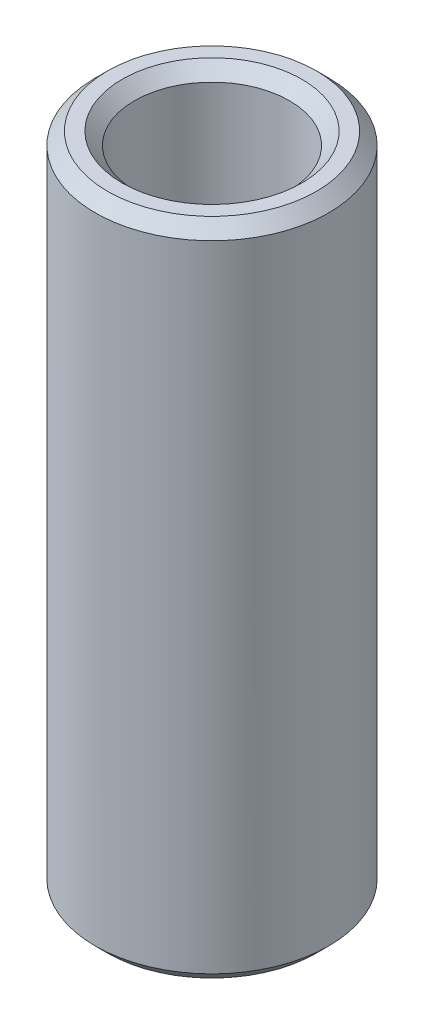
ISO-10303-21;
HEADER;
FILE_DESCRIPTION(('STEP AP214'),'2;1');
FILE_NAME('part.step','',(''),(''),'','','');
FILE_SCHEMA(('AUTOMOTIVE_DESIGN { 1 0 10303 214 1 1 1 1 }'));
ENDSEC;
DATA;
#1=APPLICATION_CONTEXT('core data for automotive mechanical design processes');
#2=APPLICATION_PROTOCOL_DEFINITION('international standard','automotive_design',2000,#1);
#3=PRODUCT_CONTEXT('',#1,'mechanical');
#4=PRODUCT('Part','Part','',(#3));
#5=PRODUCT_RELATED_PRODUCT_CATEGORY('part','',(#4));
#6=PRODUCT_DEFINITION_FORMATION('','',#4);
#7=PRODUCT_DEFINITION_CONTEXT('part definition',#1,'design');
#8=PRODUCT_DEFINITION('design','',#6,#7);
#9=PRODUCT_DEFINITION_SHAPE('','',#8);
#10=(LENGTH_UNIT() NAMED_UNIT(*) SI_UNIT(.MILLI.,.METRE.));
#11=(NAMED_UNIT(*) PLANE_ANGLE_UNIT() SI_UNIT($,.RADIAN.));
#12=(NAMED_UNIT(*) SI_UNIT($,.STERADIAN.) SOLID_ANGLE_UNIT());
#13=UNCERTAINTY_MEASURE_WITH_UNIT(LENGTH_MEASURE(1.E-05),#10,'distance_accuracy_value','');
#14=(GEOMETRIC_REPRESENTATION_CONTEXT(3) GLOBAL_UNCERTAINTY_ASSIGNED_CONTEXT((#13)) GLOBAL_UNIT_ASSIGNED_CONTEXT((#10,
#11,#12)) REPRESENTATION_CONTEXT('',''));
#15=CARTESIAN_POINT('',(0.,0.,0.));
#16=DIRECTION('',(0.,0.,1.));
#17=DIRECTION('',(1.,0.,0.));
#18=AXIS2_PLACEMENT_3D('',#15,#16,#17);
#19=CARTESIAN_POINT('',(0.,155.341796821671,0.));
#20=DIRECTION('',(0.,-1.,0.));
#21=DIRECTION('',(0.,0.,-1.));
#22=AXIS2_PLACEMENT_3D('',#19,#20,#21);
#23=CYLINDRICAL_SURFACE('',#22,27.5);
#24=CARTESIAN_POINT('',(0.,2.91568052308544,0.));
#25=DIRECTION('',(0.,1.,0.));
#26=DIRECTION('',(0.,0.,1.));
#27=AXIS2_PLACEMENT_3D('',#24,#25,#26);
#28=CIRCLE('',#27,27.5);
#29=CARTESIAN_POINT('',(0.,2.91568052308544,27.5));
#30=VERTEX_POINT('',#29);
#31=EDGE_CURVE('E10',#30,#30,#28,.T.);
#32=ORIENTED_EDGE('',*,*,#31,.T.);
#33=EDGE_LOOP('',(#32));
#34=FACE_BOUND('',#33,.T.);
#35=CARTESIAN_POINT('',(0.,152.426116298586,0.));
#36=DIRECTION('',(0.,1.,0.));
#37=DIRECTION('',(0.,0.,1.));
#38=AXIS2_PLACEMENT_3D('',#35,#36,#37);
#39=CIRCLE('',#38,27.5);
#40=CARTESIAN_POINT('',(0.,152.426116298586,-27.5));
#41=VERTEX_POINT('',#40);
#42=EDGE_CURVE('E50',#41,#41,#39,.F.);
#43=ORIENTED_EDGE('',*,*,#42,.T.);
#44=EDGE_LOOP('',(#43));
#45=FACE_BOUND('',#44,.T.);
#46=ADVANCED_FACE('F39',(#34,#45),#23,.T.);
#47=CARTESIAN_POINT('',(0.,155.341796821671,0.));
#48=DIRECTION('',(0.,1.,0.));
#49=DIRECTION('',(0.,0.,1.));
#50=AXIS2_PLACEMENT_3D('',#47,#48,#49);
#51=PLANE('',#50);
#52=CARTESIAN_POINT('',(0.,155.341796821671,0.));
#53=DIRECTION('',(0.,1.,0.));
#54=DIRECTION('',(0.,0.,1.));
#55=AXIS2_PLACEMENT_3D('',#52,#53,#54);
#56=CIRCLE('',#55,21.167257633111);
#57=CARTESIAN_POINT('',(0.,155.341796821671,21.167257633111));
#58=VERTEX_POINT('',#57);
#59=EDGE_CURVE('E58',#58,#58,#56,.F.);
#60=ORIENTED_EDGE('',*,*,#59,.T.);
#61=EDGE_LOOP('',(#60));
#62=FACE_BOUND('',#61,.T.);
#63=CARTESIAN_POINT('',(0.,155.341796821671,0.));
#64=DIRECTION('',(0.,1.,0.));
#65=DIRECTION('',(0.,0.,1.));
#66=AXIS2_PLACEMENT_3D('',#63,#64,#65);
#67=CIRCLE('',#66,24.5843194769146);
#68=CARTESIAN_POINT('',(0.,155.341796821671,-24.5843194769146));
#69=VERTEX_POINT('',#68);
#70=EDGE_CURVE('E61',#69,#69,#67,.T.);
#71=ORIENTED_EDGE('',*,*,#70,.T.);
#72=EDGE_LOOP('',(#71));
#73=FACE_BOUND('',#72,.T.);
#74=ADVANCED_FACE('F88',(#62,#73),#51,.T.);
#75=CARTESIAN_POINT('',(0.,0.,0.));
#76=DIRECTION('',(0.,1.,0.));
#77=DIRECTION('',(0.,0.,1.));
#78=AXIS2_PLACEMENT_3D('',#75,#76,#77);
#79=PLANE('',#78);
#80=CARTESIAN_POINT('',(0.,0.,0.));
#81=DIRECTION('',(0.,1.,0.));
#82=DIRECTION('',(0.,0.,1.));
#83=AXIS2_PLACEMENT_3D('',#80,#81,#82);
#84=CIRCLE('',#83,21.167257633111);
#85=CARTESIAN_POINT('',(0.,0.,-21.167257633111));
#86=VERTEX_POINT('',#85);
#87=EDGE_CURVE('E51',#86,#86,#84,.T.);
#88=ORIENTED_EDGE('',*,*,#87,.T.);
#89=EDGE_LOOP('',(#88));
#90=FACE_BOUND('',#89,.T.);
#91=CARTESIAN_POINT('',(0.,0.,0.));
#92=DIRECTION('',(0.,1.,0.));
#93=DIRECTION('',(0.,0.,1.));
#94=AXIS2_PLACEMENT_3D('',#91,#92,#93);
#95=CIRCLE('',#94,24.5843194769145);
#96=CARTESIAN_POINT('',(0.,0.,24.5843194769145));
#97=VERTEX_POINT('',#96);
#98=EDGE_CURVE('E54',#97,#97,#95,.F.);
#99=ORIENTED_EDGE('',*,*,#98,.T.);
#100=EDGE_LOOP('',(#99));
#101=FACE_BOUND('',#100,.T.);
#102=ADVANCED_FACE('F83',(#90,#101),#79,.F.);
#103=CARTESIAN_POINT('',(0.,155.341796821671,0.));
#104=DIRECTION('',(0.,-1.,0.));
#105=DIRECTION('',(0.,0.,-1.));
#106=AXIS2_PLACEMENT_3D('',#103,#104,#105);
#107=CYLINDRICAL_SURFACE('',#106,18.2515771100256);
#108=CARTESIAN_POINT('',(0.,152.426116298586,0.));
#109=DIRECTION('',(0.,1.,0.));
#110=DIRECTION('',(0.,0.,1.));
#111=AXIS2_PLACEMENT_3D('',#108,#109,#110);
#112=CIRCLE('',#111,18.2515771100256);
#113=CARTESIAN_POINT('',(0.,152.426116298586,18.2515771100256));
#114=VERTEX_POINT('',#113);
#115=EDGE_CURVE('E67',#114,#114,#112,.T.);
#116=ORIENTED_EDGE('',*,*,#115,.T.);
#117=EDGE_LOOP('',(#116));
#118=FACE_BOUND('',#117,.T.);
#119=CARTESIAN_POINT('',(0.,2.91568052308547,0.));
#120=DIRECTION('',(0.,1.,0.));
#121=DIRECTION('',(0.,0.,1.));
#122=AXIS2_PLACEMENT_3D('',#119,#120,#121);
#123=CIRCLE('',#122,18.2515771100256);
#124=CARTESIAN_POINT('',(0.,2.91568052308547,-18.2515771100256));
#125=VERTEX_POINT('',#124);
#126=EDGE_CURVE('E69',#125,#125,#123,.F.);
#127=ORIENTED_EDGE('',*,*,#126,.T.);
#128=EDGE_LOOP('',(#127));
#129=FACE_BOUND('',#128,.T.);
#130=ADVANCED_FACE('F71',(#118,#129),#107,.F.);
#131=CARTESIAN_POINT('',(0.,152.426116298586,0.));
#132=DIRECTION('',(0.,1.,0.));
#133=DIRECTION('',(0.,0.,1.));
#134=AXIS2_PLACEMENT_3D('',#131,#132,#133);
#135=CONICAL_SURFACE('',#134,18.2515771100256,0.785398163397449);
#136=ORIENTED_EDGE('',*,*,#59,.F.);
#137=EDGE_LOOP('',(#136));
#138=FACE_BOUND('',#137,.T.);
#139=ORIENTED_EDGE('',*,*,#115,.F.);
#140=EDGE_LOOP('',(#139));
#141=FACE_BOUND('',#140,.T.);
#142=ADVANCED_FACE('F77',(#138,#141),#135,.F.);
#143=CARTESIAN_POINT('',(0.,0.,0.));
#144=DIRECTION('',(0.,-1.,0.));
#145=DIRECTION('',(0.,0.,-1.));
#146=AXIS2_PLACEMENT_3D('',#143,#144,#145);
#147=CONICAL_SURFACE('',#146,21.167257633111,0.785398163397444);
#148=CARTESIAN_POINT('',(0.,2.91568052308547,-18.2515771100256));
#149=CARTESIAN_POINT('',(0.,2.88530885096999,-18.281948782141));
#150=CARTESIAN_POINT('',(0.,2.85493717885452,-18.3123204542565));
#151=CARTESIAN_POINT('',(0.,2.79419383462357,-18.3730637984875));
#152=CARTESIAN_POINT('',(0.,2.7638221625081,-18.4034354706029));
#153=CARTESIAN_POINT('',(0.,2.70307881827715,-18.4641788148339));
#154=CARTESIAN_POINT('',(0.,2.67270714616168,-18.4945504869493));
#155=CARTESIAN_POINT('',(0.,2.61196380193073,-18.5552938311803));
#156=CARTESIAN_POINT('',(0.,2.58159212981526,-18.5856655032958));
#157=CARTESIAN_POINT('',(0.,2.52084878558431,-18.6464088475267));
#158=CARTESIAN_POINT('',(0.,2.49047711346884,-18.6767805196422));
#159=CARTESIAN_POINT('',(0.,2.42973376923789,-18.7375238638731));
#160=CARTESIAN_POINT('',(0.,2.39936209712242,-18.7678955359886));
#161=CARTESIAN_POINT('',(0.,2.33861875289147,-18.8286388802196));
#162=CARTESIAN_POINT('',(0.,2.30824708077599,-18.859010552335));
#163=CARTESIAN_POINT('',(0.,2.24750373654505,-18.919753896566));
#164=CARTESIAN_POINT('',(0.,2.21713206442957,-18.9501255686814));
#165=CARTESIAN_POINT('',(0.,2.15638872019863,-19.0108689129124));
#166=CARTESIAN_POINT('',(0.,2.12601704808315,-19.0412405850279));
#167=CARTESIAN_POINT('',(0.,2.06527370385221,-19.1019839292588));
#168=CARTESIAN_POINT('',(0.,2.03490203173673,-19.1323556013743));
#169=CARTESIAN_POINT('',(0.,1.97415868750579,-19.1930989456052));
#170=CARTESIAN_POINT('',(0.,1.94378701539031,-19.2234706177207));
#171=CARTESIAN_POINT('',(0.,1.88304367115936,-19.2842139619517));
#172=CARTESIAN_POINT('',(0.,1.85267199904389,-19.3145856340671));
#173=CARTESIAN_POINT('',(0.,1.79192865481294,-19.3753289782981));
#174=CARTESIAN_POINT('',(0.,1.76155698269747,-19.4057006504135));
#175=CARTESIAN_POINT('',(0.,1.70081363846652,-19.4664439946445));
#176=CARTESIAN_POINT('',(0.,1.67044196635105,-19.49681566676));
#177=CARTESIAN_POINT('',(0.,1.6096986221201,-19.5575590109909));
#178=CARTESIAN_POINT('',(0.,1.57932695000463,-19.5879306831064));
#179=CARTESIAN_POINT('',(0.,1.51858360577368,-19.6486740273373));
#180=CARTESIAN_POINT('',(0.,1.48821193365821,-19.6790456994528));
#181=CARTESIAN_POINT('',(0.,1.42746858942726,-19.7397890436838));
#182=CARTESIAN_POINT('',(0.,1.39709691731179,-19.7701607157992));
#183=CARTESIAN_POINT('',(0.,1.33635357308084,-19.8309040600302));
#184=CARTESIAN_POINT('',(0.,1.30598190096537,-19.8612757321456));
#185=CARTESIAN_POINT('',(0.,1.24523855673442,-19.9220190763766));
#186=CARTESIAN_POINT('',(0.,1.21486688461894,-19.9523907484921));
#187=CARTESIAN_POINT('',(0.,1.154123540388,-20.013134092723));
#188=CARTESIAN_POINT('',(0.,1.12375186827252,-20.0435057648385));
#189=CARTESIAN_POINT('',(0.,1.06300852404158,-20.1042491090694));
#190=CARTESIAN_POINT('',(0.,1.0326368519261,-20.1346207811849));
#191=CARTESIAN_POINT('',(0.,0.971893507695156,-20.1953641254159));
#192=CARTESIAN_POINT('',(0.,0.941521835579682,-20.2257357975313));
#193=CARTESIAN_POINT('',(0.,0.880778491348735,-20.2864791417623));
#194=CARTESIAN_POINT('',(0.,0.850406819233261,-20.3168508138777));
#195=CARTESIAN_POINT('',(0.,0.789663475002314,-20.3775941581087));
#196=CARTESIAN_POINT('',(0.,0.75929180288684,-20.4079658302242));
#197=CARTESIAN_POINT('',(0.,0.698548458655893,-20.4687091744551));
#198=CARTESIAN_POINT('',(0.,0.66817678654042,-20.4990808465706));
#199=CARTESIAN_POINT('',(0.,0.607433442309472,-20.5598241908015));
#200=CARTESIAN_POINT('',(0.,0.577061770193999,-20.590195862917));
#201=CARTESIAN_POINT('',(0.,0.516318425963051,-20.650939207148));
#202=CARTESIAN_POINT('',(0.,0.485946753847578,-20.6813108792634));
#203=CARTESIAN_POINT('',(0.,0.425203409616631,-20.7420542234944));
#204=CARTESIAN_POINT('',(0.,0.394831737501157,-20.7724258956098));
#205=CARTESIAN_POINT('',(0.,0.33408839327021,-20.8331692398408));
#206=CARTESIAN_POINT('',(0.,0.303716721154736,-20.8635409119563));
#207=CARTESIAN_POINT('',(0.,0.242973376923789,-20.9242842561872));
#208=CARTESIAN_POINT('',(0.,0.212601704808315,-20.9546559283027));
#209=CARTESIAN_POINT('',(0.,0.151858360577368,-21.0153992725336));
#210=CARTESIAN_POINT('',(0.,0.121486688461894,-21.0457709446491));
#211=CARTESIAN_POINT('',(0.,0.0607433442309472,-21.1065142888801));
#212=CARTESIAN_POINT('',(0.,0.0303716721154736,-21.1368859609955));
#213=CARTESIAN_POINT('',(0.,0.,-21.167257633111));
#214=B_SPLINE_CURVE_WITH_KNOTS('',3,(#148,#149,#150,#151,#152,#153,#154,#155,#156,#157,#158,
#159,#160,#161,#162,#163,#164,#165,#166,#167,#168,#169,#170,#171,#172,#173,#174,#175,#176,#177,
#178,#179,#180,#181,#182,#183,#184,#185,#186,#187,#188,#189,#190,#191,#192,#193,#194,#195,#196,
#197,#198,#199,#200,#201,#202,#203,#204,#205,#206,#207,#208,#209,#210,#211,#212,#213),
.UNSPECIFIED.,.F.,.F.,(4,2,2,2,2,2,2,2,2,2,2,2,2,2,2,2,2,2,2,2,2,2,2,2,2,2,2,2,2,2,2,2,4),(0.,
0.128856091852954,0.257712183705908,0.386568275558862,0.515424367411816,0.64428045926477,
0.773136551117724,0.901992642970678,1.03084873482363,1.15970482667659,1.28856091852954,
1.41741701038249,1.54627310223545,1.6751291940884,1.80398528594136,1.93284137779431,
2.06169746964727,2.19055356150022,2.31940965335317,2.44826574520613,2.57712183705908,
2.70597792891204,2.83483402076499,2.96369011261794,3.0925462044709,3.22140229632385,
3.35025838817681,3.47911448002976,3.60797057188272,3.73682666373567,3.86568275558862,
3.99453884744158,4.12339493929453),.UNSPECIFIED.);
#215=EDGE_CURVE('BSEAM73',#125,#86,#214,.T.);
#216=ORIENTED_EDGE('',*,*,#126,.F.);
#217=ORIENTED_EDGE('',*,*,#87,.F.);
#218=ORIENTED_EDGE('',*,*,#215,.T.);
#219=ORIENTED_EDGE('',*,*,#215,.F.);
#220=EDGE_LOOP('',(#216,#218,#217,#219));
#221=FACE_BOUND('',#220,.T.);
#222=ADVANCED_FACE('F73',(#221),#147,.F.);
#223=CARTESIAN_POINT('',(0.,2.91568052308544,0.));
#224=DIRECTION('',(0.,1.,0.));
#225=DIRECTION('',(0.,0.,1.));
#226=AXIS2_PLACEMENT_3D('',#223,#224,#225);
#227=CONICAL_SURFACE('',#226,27.5,0.785398163397454);
#228=ORIENTED_EDGE('',*,*,#98,.F.);
#229=EDGE_LOOP('',(#228));
#230=FACE_BOUND('',#229,.T.);
#231=ORIENTED_EDGE('',*,*,#31,.F.);
#232=EDGE_LOOP('',(#231));
#233=FACE_BOUND('',#232,.T.);
#234=ADVANCED_FACE('F76',(#230,#233),#227,.T.);
#235=CARTESIAN_POINT('',(0.,155.341796821671,0.));
#236=DIRECTION('',(0.,-1.,0.));
#237=DIRECTION('',(0.,0.,-1.));
#238=AXIS2_PLACEMENT_3D('',#235,#236,#237);
#239=CONICAL_SURFACE('',#238,24.5843194769146,0.785398163397444);
#240=CARTESIAN_POINT('',(0.,152.426116298586,-27.5));
#241=CARTESIAN_POINT('',(0.,152.456487970701,-27.4696283278845));
#242=CARTESIAN_POINT('',(0.,152.486859642817,-27.4392566557691));
#243=CARTESIAN_POINT('',(0.,152.547602987048,-27.3785133115381));
#244=CARTESIAN_POINT('',(0.,152.577974659163,-27.3481416394226));
#245=CARTESIAN_POINT('',(0.,152.638718003394,-27.2873982951917));
#246=CARTESIAN_POINT('',(0.,152.66908967551,-27.2570266230762));
#247=CARTESIAN_POINT('',(0.,152.72983301974,-27.1962832788453));
#248=CARTESIAN_POINT('',(0.,152.760204691856,-27.1659116067298));
#249=CARTESIAN_POINT('',(0.,152.820948036087,-27.1051682624989));
#250=CARTESIAN_POINT('',(0.,152.851319708202,-27.0747965903834));
#251=CARTESIAN_POINT('',(0.,152.912063052433,-27.0140532461524));
#252=CARTESIAN_POINT('',(0.,152.942434724549,-26.983681574037));
#253=CARTESIAN_POINT('',(0.,153.00317806878,-26.922938229806));
#254=CARTESIAN_POINT('',(0.,153.033549740895,-26.8925665576905));
#255=CARTESIAN_POINT('',(0.,153.094293085126,-26.8318232134596));
#256=CARTESIAN_POINT('',(0.,153.124664757242,-26.8014515413441));
#257=CARTESIAN_POINT('',(0.,153.185408101473,-26.7407081971132));
#258=CARTESIAN_POINT('',(0.,153.215779773588,-26.7103365249977));
#259=CARTESIAN_POINT('',(0.,153.276523117819,-26.6495931807668));
#260=CARTESIAN_POINT('',(0.,153.306894789934,-26.6192215086513));
#261=CARTESIAN_POINT('',(0.,153.367638134165,-26.5584781644203));
#262=CARTESIAN_POINT('',(0.,153.398009806281,-26.5281064923049));
#263=CARTESIAN_POINT('',(0.,153.458753150512,-26.4673631480739));
#264=CARTESIAN_POINT('',(0.,153.489124822627,-26.4369914759584));
#265=CARTESIAN_POINT('',(0.,153.549868166858,-26.3762481317275));
#266=CARTESIAN_POINT('',(0.,153.580239838974,-26.345876459612));
#267=CARTESIAN_POINT('',(0.,153.640983183205,-26.2851331153811));
#268=CARTESIAN_POINT('',(0.,153.67135485532,-26.2547614432656));
#269=CARTESIAN_POINT('',(0.,153.732098199551,-26.1940180990347));
#270=CARTESIAN_POINT('',(0.,153.762469871667,-26.1636464269192));
#271=CARTESIAN_POINT('',(0.,153.823213215898,-26.1029030826882));
#272=CARTESIAN_POINT('',(0.,153.853584888013,-26.0725314105728));
#273=CARTESIAN_POINT('',(0.,153.914328232244,-26.0117880663418));
#274=CARTESIAN_POINT('',(0.,153.944699904359,-25.9814163942263));
#275=CARTESIAN_POINT('',(0.,154.00544324859,-25.9206730499954));
#276=CARTESIAN_POINT('',(0.,154.035814920706,-25.8903013778799));
#277=CARTESIAN_POINT('',(0.,154.096558264937,-25.829558033649));
#278=CARTESIAN_POINT('',(0.,154.126929937052,-25.7991863615335));
#279=CARTESIAN_POINT('',(0.,154.187673281283,-25.7384430173026));
#280=CARTESIAN_POINT('',(0.,154.218044953399,-25.7080713451871));
#281=CARTESIAN_POINT('',(0.,154.27878829763,-25.6473280009561));
#282=CARTESIAN_POINT('',(0.,154.309159969745,-25.6169563288407));
#283=CARTESIAN_POINT('',(0.,154.369903313976,-25.5562129846097));
#284=CARTESIAN_POINT('',(0.,154.400274986092,-25.5258413124942));
#285=CARTESIAN_POINT('',(0.,154.461018330322,-25.4650979682633));
#286=CARTESIAN_POINT('',(0.,154.491390002438,-25.4347262961478));
#287=CARTESIAN_POINT('',(0.,154.552133346669,-25.3739829519169));
#288=CARTESIAN_POINT('',(0.,154.582505018784,-25.3436112798014));
#289=CARTESIAN_POINT('',(0.,154.643248363015,-25.2828679355705));
#290=CARTESIAN_POINT('',(0.,154.673620035131,-25.252496263455));
#291=CARTESIAN_POINT('',(0.,154.734363379362,-25.191752919224));
#292=CARTESIAN_POINT('',(0.,154.764735051477,-25.1613812471086));
#293=CARTESIAN_POINT('',(0.,154.825478395708,-25.1006379028776));
#294=CARTESIAN_POINT('',(0.,154.855850067824,-25.0702662307621));
#295=CARTESIAN_POINT('',(0.,154.916593412055,-25.0095228865312));
#296=CARTESIAN_POINT('',(0.,154.94696508417,-24.9791512144157));
#297=CARTESIAN_POINT('',(0.,155.007708428401,-24.9184078701848));
#298=CARTESIAN_POINT('',(0.,155.038080100516,-24.8880361980693));
#299=CARTESIAN_POINT('',(0.,155.098823444747,-24.8272928538384));
#300=CARTESIAN_POINT('',(0.,155.129195116863,-24.7969211817229));
#301=CARTESIAN_POINT('',(0.,155.189938461094,-24.7361778374919));
#302=CARTESIAN_POINT('',(0.,155.220310133209,-24.7058061653765));
#303=CARTESIAN_POINT('',(0.,155.28105347744,-24.6450628211455));
#304=CARTESIAN_POINT('',(0.,155.311425149556,-24.61469114903));
#305=CARTESIAN_POINT('',(0.,155.341796821671,-24.5843194769146));
#306=B_SPLINE_CURVE_WITH_KNOTS('',3,(#240,#241,#242,#243,#244,#245,#246,#247,#248,#249,#250,
#251,#252,#253,#254,#255,#256,#257,#258,#259,#260,#261,#262,#263,#264,#265,#266,#267,#268,#269,
#270,#271,#272,#273,#274,#275,#276,#277,#278,#279,#280,#281,#282,#283,#284,#285,#286,#287,#288,
#289,#290,#291,#292,#293,#294,#295,#296,#297,#298,#299,#300,#301,#302,#303,#304,#305),
.UNSPECIFIED.,.F.,.F.,(4,2,2,2,2,2,2,2,2,2,2,2,2,2,2,2,2,2,2,2,2,2,2,2,2,2,2,2,2,2,2,2,4),(0.,
0.128856091852939,0.257712183705897,0.386568275558855,0.515424367411814,0.644280459264752,
0.773136551117711,0.901992642970669,1.03084873482363,1.15970482667659,1.28856091852952,
1.41741701038248,1.54627310223544,1.6751291940884,1.80398528594134,1.9328413777943,
2.06169746964726,2.19055356150022,2.31940965335317,2.44826574520611,2.57712183705907,
2.70597792891203,2.83483402076499,2.96369011261793,3.09254620447089,3.22140229632384,
3.3502583881768,3.47911448002976,3.6079705718827,3.73682666373566,3.86568275558862,
3.99453884744158,4.12339493929453),.UNSPECIFIED.);
#307=EDGE_CURVE('BSEAM45',#41,#69,#306,.T.);
#308=ORIENTED_EDGE('',*,*,#42,.F.);
#309=ORIENTED_EDGE('',*,*,#70,.F.);
#310=ORIENTED_EDGE('',*,*,#307,.T.);
#311=ORIENTED_EDGE('',*,*,#307,.F.);
#312=EDGE_LOOP('',(#308,#310,#309,#311));
#313=FACE_BOUND('',#312,.T.);
#314=ADVANCED_FACE('F45',(#313),#239,.T.);
#315=CLOSED_SHELL('',(#46,#74,#102,#130,#142,#222,#234,#314));
#316=MANIFOLD_SOLID_BREP('B2',#315);
#317=ADVANCED_BREP_SHAPE_REPRESENTATION('',(#18,#316),#14);
#318=SHAPE_DEFINITION_REPRESENTATION(#9,#317);
ENDSEC;
END-ISO-10303-21;
